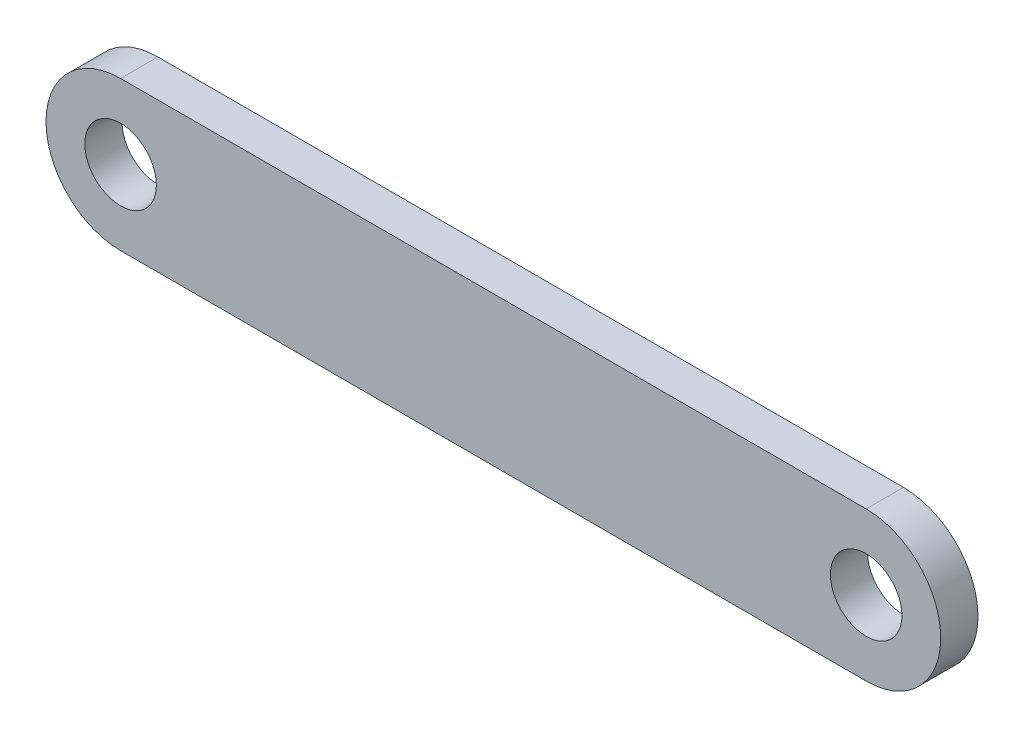
ISO-10303-21;
HEADER;
FILE_DESCRIPTION(('STEP AP214'),'2;1');
FILE_NAME('part.step','',(''),(''),'','','');
FILE_SCHEMA(('AUTOMOTIVE_DESIGN { 1 0 10303 214 1 1 1 1 }'));
ENDSEC;
DATA;
#1=APPLICATION_CONTEXT('core data for automotive mechanical design processes');
#2=APPLICATION_PROTOCOL_DEFINITION('international standard','automotive_design',2000,#1);
#3=PRODUCT_CONTEXT('',#1,'mechanical');
#4=PRODUCT('Part','Part','',(#3));
#5=PRODUCT_RELATED_PRODUCT_CATEGORY('part','',(#4));
#6=PRODUCT_DEFINITION_FORMATION('','',#4);
#7=PRODUCT_DEFINITION_CONTEXT('part definition',#1,'design');
#8=PRODUCT_DEFINITION('design','',#6,#7);
#9=PRODUCT_DEFINITION_SHAPE('','',#8);
#10=(LENGTH_UNIT() NAMED_UNIT(*) SI_UNIT(.MILLI.,.METRE.));
#11=(NAMED_UNIT(*) PLANE_ANGLE_UNIT() SI_UNIT($,.RADIAN.));
#12=(NAMED_UNIT(*) SI_UNIT($,.STERADIAN.) SOLID_ANGLE_UNIT());
#13=UNCERTAINTY_MEASURE_WITH_UNIT(LENGTH_MEASURE(1.E-05),#10,'distance_accuracy_value','');
#14=(GEOMETRIC_REPRESENTATION_CONTEXT(3) GLOBAL_UNCERTAINTY_ASSIGNED_CONTEXT((#13)) GLOBAL_UNIT_ASSIGNED_CONTEXT((#10,
#11,#12)) REPRESENTATION_CONTEXT('',''));
#15=CARTESIAN_POINT('',(0.,0.,0.));
#16=DIRECTION('',(0.,0.,1.));
#17=DIRECTION('',(1.,0.,0.));
#18=AXIS2_PLACEMENT_3D('',#15,#16,#17);
#19=CARTESIAN_POINT('',(31.7500000000001,0.,3.175));
#20=DIRECTION('',(0.,0.,1.));
#21=DIRECTION('',(1.,0.,0.));
#22=AXIS2_PLACEMENT_3D('',#19,#20,#21);
#23=PLANE('',#22);
#24=CARTESIAN_POINT('',(31.7500000000001,0.,3.175));
#25=DIRECTION('',(0.,0.,1.));
#26=DIRECTION('',(1.,0.,0.));
#27=AXIS2_PLACEMENT_3D('',#24,#25,#26);
#28=CIRCLE('',#27,3.048);
#29=CARTESIAN_POINT('',(34.7980000000001,0.,3.175));
#30=VERTEX_POINT('',#29);
#31=EDGE_CURVE('E112',#30,#30,#28,.T.);
#32=ORIENTED_EDGE('',*,*,#31,.F.);
#33=EDGE_LOOP('',(#32));
#34=FACE_BOUND('',#33,.T.);
#35=CARTESIAN_POINT('',(31.7500000000001,0.,3.175));
#36=DIRECTION('',(0.,0.,1.));
#37=DIRECTION('',(1.,0.,0.));
#38=AXIS2_PLACEMENT_3D('',#35,#36,#37);
#39=CIRCLE('',#38,6.35);
#40=CARTESIAN_POINT('',(31.7500000000001,-6.35,3.175));
#41=VERTEX_POINT('',#40);
#42=CARTESIAN_POINT('',(31.7500000000001,6.35000000000001,3.175));
#43=VERTEX_POINT('',#42);
#44=EDGE_CURVE('E92',#41,#43,#39,.T.);
#45=ORIENTED_EDGE('',*,*,#44,.T.);
#46=DIRECTION('',(-1.,0.,0.));
#47=VECTOR('',#46,1.);
#48=CARTESIAN_POINT('',(-31.75,6.35,3.175));
#49=LINE('',#48,#47);
#50=CARTESIAN_POINT('',(-31.75,6.35,3.175));
#51=VERTEX_POINT('',#50);
#52=EDGE_CURVE('E87',#43,#51,#49,.T.);
#53=ORIENTED_EDGE('',*,*,#52,.T.);
#54=CARTESIAN_POINT('',(-31.75,0.,3.175));
#55=DIRECTION('',(0.,0.,1.));
#56=DIRECTION('',(1.,0.,0.));
#57=AXIS2_PLACEMENT_3D('',#54,#55,#56);
#58=CIRCLE('',#57,6.35);
#59=CARTESIAN_POINT('',(-31.75,-6.35,3.175));
#60=VERTEX_POINT('',#59);
#61=EDGE_CURVE('E90',#51,#60,#58,.T.);
#62=ORIENTED_EDGE('',*,*,#61,.T.);
#63=DIRECTION('',(1.,0.,0.));
#64=VECTOR('',#63,1.);
#65=CARTESIAN_POINT('',(-31.75,-6.35,3.175));
#66=LINE('',#65,#64);
#67=EDGE_CURVE('E57',#60,#41,#66,.T.);
#68=ORIENTED_EDGE('',*,*,#67,.T.);
#69=EDGE_LOOP('',(#45,#53,#62,#68));
#70=FACE_BOUND('',#69,.T.);
#71=CARTESIAN_POINT('',(-31.75,0.,3.175));
#72=DIRECTION('',(0.,0.,1.));
#73=DIRECTION('',(1.,0.,0.));
#74=AXIS2_PLACEMENT_3D('',#71,#72,#73);
#75=CIRCLE('',#74,3.048);
#76=CARTESIAN_POINT('',(-28.702,0.,3.175));
#77=VERTEX_POINT('',#76);
#78=EDGE_CURVE('E134',#77,#77,#75,.T.);
#79=ORIENTED_EDGE('',*,*,#78,.F.);
#80=EDGE_LOOP('',(#79));
#81=FACE_BOUND('',#80,.T.);
#82=ADVANCED_FACE('F39',(#34,#70,#81),#23,.T.);
#83=CARTESIAN_POINT('',(31.7500000000001,0.,0.));
#84=DIRECTION('',(0.,0.,1.));
#85=DIRECTION('',(1.,0.,0.));
#86=AXIS2_PLACEMENT_3D('',#83,#84,#85);
#87=PLANE('',#86);
#88=CARTESIAN_POINT('',(31.7500000000001,0.,0.));
#89=DIRECTION('',(0.,0.,1.));
#90=DIRECTION('',(1.,0.,0.));
#91=AXIS2_PLACEMENT_3D('',#88,#89,#90);
#92=CIRCLE('',#91,6.35);
#93=CARTESIAN_POINT('',(31.7500000000001,-6.35,0.));
#94=VERTEX_POINT('',#93);
#95=CARTESIAN_POINT('',(31.7500000000001,6.35000000000001,0.));
#96=VERTEX_POINT('',#95);
#97=EDGE_CURVE('E108',#94,#96,#92,.T.);
#98=ORIENTED_EDGE('',*,*,#97,.F.);
#99=DIRECTION('',(1.,0.,0.));
#100=VECTOR('',#99,1.);
#101=CARTESIAN_POINT('',(-31.75,-6.35,0.));
#102=LINE('',#101,#100);
#103=CARTESIAN_POINT('',(-31.75,-6.35,0.));
#104=VERTEX_POINT('',#103);
#105=EDGE_CURVE('E80',#104,#94,#102,.T.);
#106=ORIENTED_EDGE('',*,*,#105,.F.);
#107=CARTESIAN_POINT('',(-31.75,0.,0.));
#108=DIRECTION('',(0.,0.,1.));
#109=DIRECTION('',(1.,0.,0.));
#110=AXIS2_PLACEMENT_3D('',#107,#108,#109);
#111=CIRCLE('',#110,6.35);
#112=CARTESIAN_POINT('',(-31.75,6.35,0.));
#113=VERTEX_POINT('',#112);
#114=EDGE_CURVE('E74',#113,#104,#111,.T.);
#115=ORIENTED_EDGE('',*,*,#114,.F.);
#116=DIRECTION('',(-1.,0.,0.));
#117=VECTOR('',#116,1.);
#118=CARTESIAN_POINT('',(-31.75,6.35,0.));
#119=LINE('',#118,#117);
#120=EDGE_CURVE('E97',#96,#113,#119,.T.);
#121=ORIENTED_EDGE('',*,*,#120,.F.);
#122=EDGE_LOOP('',(#98,#106,#115,#121));
#123=FACE_BOUND('',#122,.T.);
#124=CARTESIAN_POINT('',(31.7500000000001,0.,0.));
#125=DIRECTION('',(0.,0.,1.));
#126=DIRECTION('',(1.,0.,0.));
#127=AXIS2_PLACEMENT_3D('',#124,#125,#126);
#128=CIRCLE('',#127,3.048);
#129=CARTESIAN_POINT('',(34.7980000000001,0.,0.));
#130=VERTEX_POINT('',#129);
#131=EDGE_CURVE('E130',#130,#130,#128,.T.);
#132=ORIENTED_EDGE('',*,*,#131,.T.);
#133=EDGE_LOOP('',(#132));
#134=FACE_BOUND('',#133,.T.);
#135=CARTESIAN_POINT('',(-31.75,0.,0.));
#136=DIRECTION('',(0.,0.,1.));
#137=DIRECTION('',(1.,0.,0.));
#138=AXIS2_PLACEMENT_3D('',#135,#136,#137);
#139=CIRCLE('',#138,3.048);
#140=CARTESIAN_POINT('',(-28.702,0.,0.));
#141=VERTEX_POINT('',#140);
#142=EDGE_CURVE('E138',#141,#141,#139,.T.);
#143=ORIENTED_EDGE('',*,*,#142,.T.);
#144=EDGE_LOOP('',(#143));
#145=FACE_BOUND('',#144,.T.);
#146=ADVANCED_FACE('F125',(#123,#134,#145),#87,.F.);
#147=CARTESIAN_POINT('',(31.7500000000001,0.,3.175));
#148=DIRECTION('',(0.,0.,-1.));
#149=DIRECTION('',(-1.,0.,0.));
#150=AXIS2_PLACEMENT_3D('',#147,#148,#149);
#151=CYLINDRICAL_SURFACE('',#150,6.35);
#152=ORIENTED_EDGE('',*,*,#97,.T.);
#153=DIRECTION('',(0.,0.,-1.));
#154=VECTOR('',#153,1.);
#155=CARTESIAN_POINT('',(31.7500000000001,6.35000000000001,3.175));
#156=LINE('',#155,#154);
#157=EDGE_CURVE('E11',#43,#96,#156,.T.);
#158=ORIENTED_EDGE('',*,*,#157,.F.);
#159=ORIENTED_EDGE('',*,*,#44,.F.);
#160=DIRECTION('',(0.,0.,-1.));
#161=VECTOR('',#160,1.);
#162=CARTESIAN_POINT('',(31.7500000000001,-6.35,3.175));
#163=LINE('',#162,#161);
#164=EDGE_CURVE('E104',#41,#94,#163,.T.);
#165=ORIENTED_EDGE('',*,*,#164,.T.);
#166=EDGE_LOOP('',(#152,#158,#159,#165));
#167=FACE_BOUND('',#166,.T.);
#168=ADVANCED_FACE('F41',(#167),#151,.T.);
#169=CARTESIAN_POINT('',(-31.75,6.35,3.175));
#170=DIRECTION('',(0.,-1.,0.));
#171=DIRECTION('',(1.,0.,0.));
#172=AXIS2_PLACEMENT_3D('',#169,#170,#171);
#173=PLANE('',#172);
#174=ORIENTED_EDGE('',*,*,#120,.T.);
#175=DIRECTION('',(0.,0.,-1.));
#176=VECTOR('',#175,1.);
#177=CARTESIAN_POINT('',(-31.75,6.35,3.175));
#178=LINE('',#177,#176);
#179=EDGE_CURVE('E49',#51,#113,#178,.T.);
#180=ORIENTED_EDGE('',*,*,#179,.F.);
#181=ORIENTED_EDGE('',*,*,#52,.F.);
#182=ORIENTED_EDGE('',*,*,#157,.T.);
#183=EDGE_LOOP('',(#174,#180,#181,#182));
#184=FACE_BOUND('',#183,.T.);
#185=ADVANCED_FACE('F96',(#184),#173,.F.);
#186=CARTESIAN_POINT('',(-31.75,0.,3.175));
#187=DIRECTION('',(0.,0.,-1.));
#188=DIRECTION('',(-1.,0.,0.));
#189=AXIS2_PLACEMENT_3D('',#186,#187,#188);
#190=CYLINDRICAL_SURFACE('',#189,6.35);
#191=ORIENTED_EDGE('',*,*,#114,.T.);
#192=DIRECTION('',(0.,0.,-1.));
#193=VECTOR('',#192,1.);
#194=CARTESIAN_POINT('',(-31.75,-6.35,3.175));
#195=LINE('',#194,#193);
#196=EDGE_CURVE('E99',#60,#104,#195,.T.);
#197=ORIENTED_EDGE('',*,*,#196,.F.);
#198=ORIENTED_EDGE('',*,*,#61,.F.);
#199=ORIENTED_EDGE('',*,*,#179,.T.);
#200=EDGE_LOOP('',(#191,#197,#198,#199));
#201=FACE_BOUND('',#200,.T.);
#202=ADVANCED_FACE('F100',(#201),#190,.T.);
#203=CARTESIAN_POINT('',(-31.75,-6.35,3.175));
#204=DIRECTION('',(0.,1.,0.));
#205=DIRECTION('',(0.,0.,1.));
#206=AXIS2_PLACEMENT_3D('',#203,#204,#205);
#207=PLANE('',#206);
#208=ORIENTED_EDGE('',*,*,#105,.T.);
#209=ORIENTED_EDGE('',*,*,#164,.F.);
#210=ORIENTED_EDGE('',*,*,#67,.F.);
#211=ORIENTED_EDGE('',*,*,#196,.T.);
#212=EDGE_LOOP('',(#208,#209,#210,#211));
#213=FACE_BOUND('',#212,.T.);
#214=ADVANCED_FACE('F122',(#213),#207,.F.);
#215=CARTESIAN_POINT('',(31.7500000000001,0.,3.175));
#216=DIRECTION('',(0.,0.,-1.));
#217=DIRECTION('',(-1.,0.,0.));
#218=AXIS2_PLACEMENT_3D('',#215,#216,#217);
#219=CYLINDRICAL_SURFACE('',#218,3.048);
#220=ORIENTED_EDGE('',*,*,#31,.T.);
#221=EDGE_LOOP('',(#220));
#222=FACE_BOUND('',#221,.T.);
#223=ORIENTED_EDGE('',*,*,#131,.F.);
#224=EDGE_LOOP('',(#223));
#225=FACE_BOUND('',#224,.T.);
#226=ADVANCED_FACE('F157',(#222,#225),#219,.F.);
#227=CARTESIAN_POINT('',(-31.75,0.,3.175));
#228=DIRECTION('',(0.,0.,-1.));
#229=DIRECTION('',(-1.,0.,0.));
#230=AXIS2_PLACEMENT_3D('',#227,#228,#229);
#231=CYLINDRICAL_SURFACE('',#230,3.048);
#232=ORIENTED_EDGE('',*,*,#78,.T.);
#233=EDGE_LOOP('',(#232));
#234=FACE_BOUND('',#233,.T.);
#235=ORIENTED_EDGE('',*,*,#142,.F.);
#236=EDGE_LOOP('',(#235));
#237=FACE_BOUND('',#236,.T.);
#238=ADVANCED_FACE('F146',(#234,#237),#231,.F.);
#239=CLOSED_SHELL('',(#82,#146,#168,#185,#202,#214,#226,#238));
#240=MANIFOLD_SOLID_BREP('B2',#239);
#241=ADVANCED_BREP_SHAPE_REPRESENTATION('',(#18,#240),#14);
#242=SHAPE_DEFINITION_REPRESENTATION(#9,#241);
ENDSEC;
END-ISO-10303-21;
